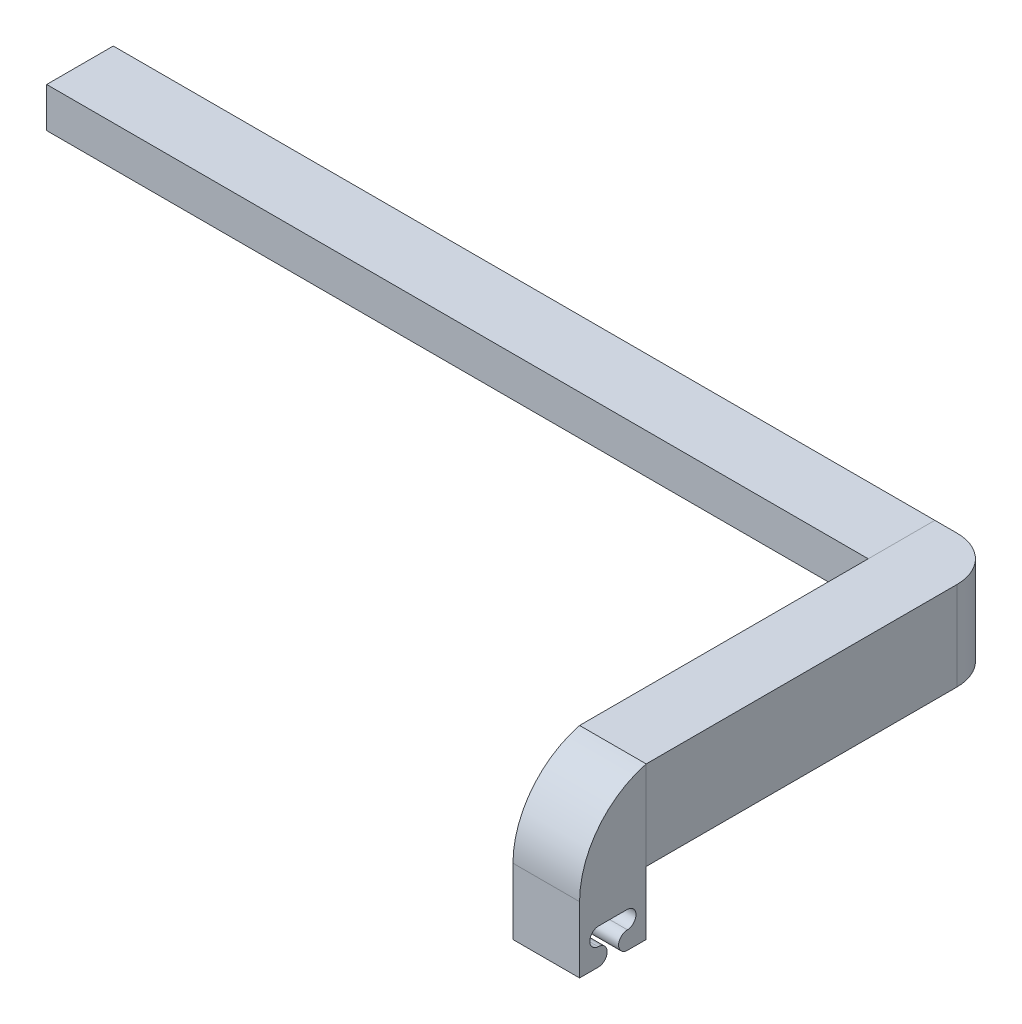
ISO-10303-21;
HEADER;
FILE_DESCRIPTION(('STEP AP214'),'2;1');
FILE_NAME('part.step','',(''),(''),'','','');
FILE_SCHEMA(('AUTOMOTIVE_DESIGN { 1 0 10303 214 1 1 1 1 }'));
ENDSEC;
DATA;
#1=APPLICATION_CONTEXT('core data for automotive mechanical design processes');
#2=APPLICATION_PROTOCOL_DEFINITION('international standard','automotive_design',2000,#1);
#3=PRODUCT_CONTEXT('',#1,'mechanical');
#4=PRODUCT('Part','Part','',(#3));
#5=PRODUCT_RELATED_PRODUCT_CATEGORY('part','',(#4));
#6=PRODUCT_DEFINITION_FORMATION('','',#4);
#7=PRODUCT_DEFINITION_CONTEXT('part definition',#1,'design');
#8=PRODUCT_DEFINITION('design','',#6,#7);
#9=PRODUCT_DEFINITION_SHAPE('','',#8);
#10=(LENGTH_UNIT() NAMED_UNIT(*) SI_UNIT(.MILLI.,.METRE.));
#11=(NAMED_UNIT(*) PLANE_ANGLE_UNIT() SI_UNIT($,.RADIAN.));
#12=(NAMED_UNIT(*) SI_UNIT($,.STERADIAN.) SOLID_ANGLE_UNIT());
#13=UNCERTAINTY_MEASURE_WITH_UNIT(LENGTH_MEASURE(1.E-05),#10,'distance_accuracy_value','');
#14=(GEOMETRIC_REPRESENTATION_CONTEXT(3) GLOBAL_UNCERTAINTY_ASSIGNED_CONTEXT((#13)) GLOBAL_UNIT_ASSIGNED_CONTEXT((#10,
#11,#12)) REPRESENTATION_CONTEXT('',''));
#15=CARTESIAN_POINT('',(0.,0.,0.));
#16=DIRECTION('',(0.,0.,1.));
#17=DIRECTION('',(1.,0.,0.));
#18=AXIS2_PLACEMENT_3D('',#15,#16,#17);
#19=CARTESIAN_POINT('',(44.416899440769,-15.6274777520744,-28.75));
#20=DIRECTION('',(1.,0.,0.));
#21=DIRECTION('',(0.,0.,-1.));
#22=AXIS2_PLACEMENT_3D('',#19,#20,#21);
#23=PLANE('',#22);
#24=DIRECTION('',(0.,-1.,0.));
#25=VECTOR('',#24,1.);
#26=CARTESIAN_POINT('',(44.416899440769,-15.6274777520745,-36.25));
#27=LINE('',#26,#25);
#28=CARTESIAN_POINT('',(44.416899440769,-15.6274777520745,-36.25));
#29=VERTEX_POINT('',#28);
#30=CARTESIAN_POINT('',(44.416899440769,-20.1274777520745,-36.25));
#31=VERTEX_POINT('',#30);
#32=EDGE_CURVE('E124',#29,#31,#27,.T.);
#33=ORIENTED_EDGE('',*,*,#32,.F.);
#34=DIRECTION('',(0.,0.,-1.));
#35=VECTOR('',#34,1.);
#36=CARTESIAN_POINT('',(44.416899440769,-15.6274777520744,-28.75));
#37=LINE('',#36,#35);
#38=CARTESIAN_POINT('',(44.416899440769,-15.6274777520744,-28.75));
#39=VERTEX_POINT('',#38);
#40=EDGE_CURVE('E12',#39,#29,#37,.T.);
#41=ORIENTED_EDGE('',*,*,#40,.F.);
#42=DIRECTION('',(0.,-1.,0.));
#43=VECTOR('',#42,1.);
#44=CARTESIAN_POINT('',(44.416899440769,-15.6274777520744,-28.75));
#45=LINE('',#44,#43);
#46=CARTESIAN_POINT('',(44.416899440769,-20.1274777520744,-28.75));
#47=VERTEX_POINT('',#46);
#48=EDGE_CURVE('E116',#39,#47,#45,.T.);
#49=ORIENTED_EDGE('',*,*,#48,.T.);
#50=DIRECTION('',(0.,0.,-1.));
#51=VECTOR('',#50,1.);
#52=CARTESIAN_POINT('',(44.416899440769,-20.1274777520744,-28.75));
#53=LINE('',#52,#51);
#54=EDGE_CURVE('E57',#47,#31,#53,.T.);
#55=ORIENTED_EDGE('',*,*,#54,.T.);
#56=EDGE_LOOP('',(#33,#41,#49,#55));
#57=FACE_BOUND('',#56,.T.);
#58=ADVANCED_FACE('F54',(#57),#23,.T.);
#59=CARTESIAN_POINT('',(44.416899440769,-15.6274777520744,-28.75));
#60=DIRECTION('',(0.,1.,0.));
#61=DIRECTION('',(0.,0.,1.));
#62=AXIS2_PLACEMENT_3D('',#59,#60,#61);
#63=PLANE('',#62);
#64=DIRECTION('',(1.,0.,0.));
#65=VECTOR('',#64,1.);
#66=CARTESIAN_POINT('',(44.416899440769,-15.6274777520745,-36.25));
#67=LINE('',#66,#65);
#68=CARTESIAN_POINT('',(-48.083100559231,-15.6274777520745,-36.25));
#69=VERTEX_POINT('',#68);
#70=EDGE_CURVE('E119',#69,#29,#67,.T.);
#71=ORIENTED_EDGE('',*,*,#70,.F.);
#72=DIRECTION('',(0.,0.,-1.));
#73=VECTOR('',#72,1.);
#74=CARTESIAN_POINT('',(-48.083100559231,-15.6274777520744,-28.75));
#75=LINE('',#74,#73);
#76=CARTESIAN_POINT('',(-48.083100559231,-15.6274777520744,-28.75));
#77=VERTEX_POINT('',#76);
#78=EDGE_CURVE('E64',#77,#69,#75,.T.);
#79=ORIENTED_EDGE('',*,*,#78,.F.);
#80=DIRECTION('',(1.,0.,0.));
#81=VECTOR('',#80,1.);
#82=CARTESIAN_POINT('',(44.416899440769,-15.6274777520744,-28.75));
#83=LINE('',#82,#81);
#84=EDGE_CURVE('E111',#77,#39,#83,.T.);
#85=ORIENTED_EDGE('',*,*,#84,.T.);
#86=ORIENTED_EDGE('',*,*,#40,.T.);
#87=EDGE_LOOP('',(#71,#79,#85,#86));
#88=FACE_BOUND('',#87,.T.);
#89=ADVANCED_FACE('F140',(#88),#63,.T.);
#90=CARTESIAN_POINT('',(-48.083100559231,-15.6274777520744,-28.75));
#91=DIRECTION('',(-1.,0.,0.));
#92=DIRECTION('',(0.,0.,1.));
#93=AXIS2_PLACEMENT_3D('',#90,#91,#92);
#94=PLANE('',#93);
#95=DIRECTION('',(0.,1.,0.));
#96=VECTOR('',#95,1.);
#97=CARTESIAN_POINT('',(-48.083100559231,-15.6274777520745,-36.25));
#98=LINE('',#97,#96);
#99=CARTESIAN_POINT('',(-48.083100559231,-20.1274777520745,-36.25));
#100=VERTEX_POINT('',#99);
#101=EDGE_CURVE('E105',#100,#69,#98,.T.);
#102=ORIENTED_EDGE('',*,*,#101,.F.);
#103=DIRECTION('',(0.,0.,-1.));
#104=VECTOR('',#103,1.);
#105=CARTESIAN_POINT('',(-48.083100559231,-20.1274777520744,-28.75));
#106=LINE('',#105,#104);
#107=CARTESIAN_POINT('',(-48.083100559231,-20.1274777520744,-28.75));
#108=VERTEX_POINT('',#107);
#109=EDGE_CURVE('E100',#108,#100,#106,.T.);
#110=ORIENTED_EDGE('',*,*,#109,.F.);
#111=DIRECTION('',(0.,1.,0.));
#112=VECTOR('',#111,1.);
#113=CARTESIAN_POINT('',(-48.083100559231,-15.6274777520744,-28.75));
#114=LINE('',#113,#112);
#115=EDGE_CURVE('E103',#108,#77,#114,.T.);
#116=ORIENTED_EDGE('',*,*,#115,.T.);
#117=ORIENTED_EDGE('',*,*,#78,.T.);
#118=EDGE_LOOP('',(#102,#110,#116,#117));
#119=FACE_BOUND('',#118,.T.);
#120=ADVANCED_FACE('F102',(#119),#94,.T.);
#121=CARTESIAN_POINT('',(44.416899440769,-20.1274777520744,-28.75));
#122=DIRECTION('',(0.,-1.,0.));
#123=DIRECTION('',(0.,0.,-1.));
#124=AXIS2_PLACEMENT_3D('',#121,#122,#123);
#125=PLANE('',#124);
#126=DIRECTION('',(-1.,0.,0.));
#127=VECTOR('',#126,1.);
#128=CARTESIAN_POINT('',(44.416899440769,-20.1274777520745,-36.25));
#129=LINE('',#128,#127);
#130=EDGE_CURVE('E128',#31,#100,#129,.T.);
#131=ORIENTED_EDGE('',*,*,#130,.F.);
#132=ORIENTED_EDGE('',*,*,#54,.F.);
#133=DIRECTION('',(-1.,0.,0.));
#134=VECTOR('',#133,1.);
#135=CARTESIAN_POINT('',(44.416899440769,-20.1274777520744,-28.75));
#136=LINE('',#135,#134);
#137=EDGE_CURVE('E110',#47,#108,#136,.T.);
#138=ORIENTED_EDGE('',*,*,#137,.T.);
#139=ORIENTED_EDGE('',*,*,#109,.T.);
#140=EDGE_LOOP('',(#131,#132,#138,#139));
#141=FACE_BOUND('',#140,.T.);
#142=ADVANCED_FACE('F114',(#141),#125,.T.);
#143=CARTESIAN_POINT('',(0.,0.,-28.75));
#144=DIRECTION('',(0.,0.,-1.));
#145=DIRECTION('',(-1.,0.,0.));
#146=AXIS2_PLACEMENT_3D('',#143,#144,#145);
#147=PLANE('',#146);
#148=ORIENTED_EDGE('',*,*,#48,.F.);
#149=ORIENTED_EDGE('',*,*,#84,.F.);
#150=ORIENTED_EDGE('',*,*,#115,.F.);
#151=ORIENTED_EDGE('',*,*,#137,.F.);
#152=EDGE_LOOP('',(#148,#149,#150,#151));
#153=FACE_BOUND('',#152,.T.);
#154=ADVANCED_FACE('F109',(#153),#147,.F.);
#155=CARTESIAN_POINT('',(0.,0.,-36.25));
#156=DIRECTION('',(0.,0.,-1.));
#157=DIRECTION('',(-1.,0.,0.));
#158=AXIS2_PLACEMENT_3D('',#155,#156,#157);
#159=PLANE('',#158);
#160=ORIENTED_EDGE('',*,*,#32,.T.);
#161=ORIENTED_EDGE('',*,*,#130,.T.);
#162=ORIENTED_EDGE('',*,*,#101,.T.);
#163=ORIENTED_EDGE('',*,*,#70,.T.);
#164=EDGE_LOOP('',(#160,#161,#162,#163));
#165=FACE_BOUND('',#164,.T.);
#166=ADVANCED_FACE('F139',(#165),#159,.T.);
#167=CLOSED_SHELL('',(#58,#89,#120,#142,#154,#166));
#168=MANIFOLD_SOLID_BREP('B2',#167);
#169=CARTESIAN_POINT('',(44.416899440769,-15.6274777520745,3.75));
#170=DIRECTION('',(0.,0.,1.));
#171=DIRECTION('',(0.,-1.,0.));
#172=AXIS2_PLACEMENT_3D('',#169,#170,#171);
#173=PLANE('',#172);
#174=DIRECTION('',(0.,-1.,0.));
#175=VECTOR('',#174,1.);
#176=CARTESIAN_POINT('',(51.916899440769,-15.6274777520745,3.75));
#177=LINE('',#176,#175);
#178=CARTESIAN_POINT('',(51.916899440769,-15.6274777520745,3.75));
#179=VERTEX_POINT('',#178);
#180=CARTESIAN_POINT('',(51.916899440769,-25.6274777520745,3.75));
#181=VERTEX_POINT('',#180);
#182=EDGE_CURVE('E275',#179,#181,#177,.T.);
#183=ORIENTED_EDGE('',*,*,#182,.F.);
#184=DIRECTION('',(1.,0.,0.));
#185=VECTOR('',#184,1.);
#186=CARTESIAN_POINT('',(44.416899440769,-15.6274777520745,3.75));
#187=LINE('',#186,#185);
#188=CARTESIAN_POINT('',(44.416899440769,-15.6274777520745,3.75));
#189=VERTEX_POINT('',#188);
#190=EDGE_CURVE('E268',#189,#179,#187,.T.);
#191=ORIENTED_EDGE('',*,*,#190,.F.);
#192=DIRECTION('',(0.,-1.,0.));
#193=VECTOR('',#192,1.);
#194=CARTESIAN_POINT('',(44.416899440769,-15.6274777520745,3.75));
#195=LINE('',#194,#193);
#196=CARTESIAN_POINT('',(44.416899440769,-25.6274777520745,3.75));
#197=VERTEX_POINT('',#196);
#198=EDGE_CURVE('E262',#189,#197,#195,.T.);
#199=ORIENTED_EDGE('',*,*,#198,.T.);
#200=DIRECTION('',(1.,0.,0.));
#201=VECTOR('',#200,1.);
#202=CARTESIAN_POINT('',(44.416899440769,-25.6274777520745,3.75));
#203=LINE('',#202,#201);
#204=EDGE_CURVE('E244',#197,#181,#203,.T.);
#205=ORIENTED_EDGE('',*,*,#204,.T.);
#206=EDGE_LOOP('',(#183,#191,#199,#205));
#207=FACE_BOUND('',#206,.T.);
#208=ADVANCED_FACE('F199',(#207),#173,.T.);
#209=CARTESIAN_POINT('',(44.416899440769,-15.6274777520745,3.75));
#210=DIRECTION('',(0.,1.,0.));
#211=DIRECTION('',(0.,0.,1.));
#212=AXIS2_PLACEMENT_3D('',#209,#210,#211);
#213=PLANE('',#212);
#214=DIRECTION('',(0.,0.,1.));
#215=VECTOR('',#214,1.);
#216=CARTESIAN_POINT('',(51.916899440769,-15.6274777520745,3.75));
#217=LINE('',#216,#215);
#218=CARTESIAN_POINT('',(51.916899440769,-15.6274777520745,-31.25));
#219=VERTEX_POINT('',#218);
#220=EDGE_CURVE('E269',#219,#179,#217,.T.);
#221=ORIENTED_EDGE('',*,*,#220,.F.);
#222=CARTESIAN_POINT('',(46.916899440769,-15.6274777520745,-31.25));
#223=DIRECTION('',(0.,1.,0.));
#224=DIRECTION('',(0.,0.,1.));
#225=AXIS2_PLACEMENT_3D('',#222,#223,#224);
#226=CIRCLE('',#225,5.);
#227=CARTESIAN_POINT('',(46.916899440769,-15.6274777520745,-36.25));
#228=VERTEX_POINT('',#227);
#229=EDGE_CURVE('E221',#219,#228,#226,.T.);
#230=ORIENTED_EDGE('',*,*,#229,.T.);
#231=DIRECTION('',(1.,0.,0.));
#232=VECTOR('',#231,1.);
#233=CARTESIAN_POINT('',(44.416899440769,-15.6274777520745,-36.25));
#234=LINE('',#233,#232);
#235=CARTESIAN_POINT('',(44.416899440769,-15.6274777520745,-36.25));
#236=VERTEX_POINT('',#235);
#237=EDGE_CURVE('E280',#236,#228,#234,.T.);
#238=ORIENTED_EDGE('',*,*,#237,.F.);
#239=DIRECTION('',(0.,0.,1.));
#240=VECTOR('',#239,1.);
#241=CARTESIAN_POINT('',(44.416899440769,-15.6274777520745,3.75));
#242=LINE('',#241,#240);
#243=EDGE_CURVE('E255',#236,#189,#242,.T.);
#244=ORIENTED_EDGE('',*,*,#243,.T.);
#245=ORIENTED_EDGE('',*,*,#190,.T.);
#246=EDGE_LOOP('',(#221,#230,#238,#244,#245));
#247=FACE_BOUND('',#246,.T.);
#248=ADVANCED_FACE('F290',(#247),#213,.T.);
#249=CARTESIAN_POINT('',(44.416899440769,-15.6274777520745,-36.25));
#250=DIRECTION('',(0.,0.,-1.));
#251=DIRECTION('',(0.,1.,0.));
#252=AXIS2_PLACEMENT_3D('',#249,#250,#251);
#253=PLANE('',#252);
#254=ORIENTED_EDGE('',*,*,#237,.T.);
#255=DIRECTION('',(0.,1.,0.));
#256=VECTOR('',#255,1.);
#257=CARTESIAN_POINT('',(46.916899440769,-15.6274777520745,-36.25));
#258=LINE('',#257,#256);
#259=CARTESIAN_POINT('',(46.916899440769,-25.6274777520745,-36.25));
#260=VERTEX_POINT('',#259);
#261=EDGE_CURVE('E207',#228,#260,#258,.F.);
#262=ORIENTED_EDGE('',*,*,#261,.T.);
#263=DIRECTION('',(1.,0.,0.));
#264=VECTOR('',#263,1.);
#265=CARTESIAN_POINT('',(44.416899440769,-25.6274777520745,-36.25));
#266=LINE('',#265,#264);
#267=CARTESIAN_POINT('',(44.416899440769,-25.6274777520745,-36.25));
#268=VERTEX_POINT('',#267);
#269=EDGE_CURVE('E254',#268,#260,#266,.T.);
#270=ORIENTED_EDGE('',*,*,#269,.F.);
#271=DIRECTION('',(0.,1.,0.));
#272=VECTOR('',#271,1.);
#273=CARTESIAN_POINT('',(44.416899440769,-15.6274777520745,-36.25));
#274=LINE('',#273,#272);
#275=EDGE_CURVE('E265',#268,#236,#274,.T.);
#276=ORIENTED_EDGE('',*,*,#275,.T.);
#277=EDGE_LOOP('',(#254,#262,#270,#276));
#278=FACE_BOUND('',#277,.T.);
#279=ADVANCED_FACE('F291',(#278),#253,.T.);
#280=CARTESIAN_POINT('',(44.416899440769,-25.6274777520745,3.75));
#281=DIRECTION('',(0.,-1.,0.));
#282=DIRECTION('',(0.,0.,-1.));
#283=AXIS2_PLACEMENT_3D('',#280,#281,#282);
#284=PLANE('',#283);
#285=ORIENTED_EDGE('',*,*,#269,.T.);
#286=CARTESIAN_POINT('',(46.916899440769,-25.6274777520745,-31.25));
#287=DIRECTION('',(0.,-1.,0.));
#288=DIRECTION('',(0.,0.,-1.));
#289=AXIS2_PLACEMENT_3D('',#286,#287,#288);
#290=CIRCLE('',#289,5.);
#291=CARTESIAN_POINT('',(51.916899440769,-25.6274777520745,-31.25));
#292=VERTEX_POINT('',#291);
#293=EDGE_CURVE('E52',#260,#292,#290,.T.);
#294=ORIENTED_EDGE('',*,*,#293,.T.);
#295=DIRECTION('',(0.,0.,-1.));
#296=VECTOR('',#295,1.);
#297=CARTESIAN_POINT('',(51.916899440769,-25.6274777520745,3.75));
#298=LINE('',#297,#296);
#299=EDGE_CURVE('E249',#181,#292,#298,.T.);
#300=ORIENTED_EDGE('',*,*,#299,.F.);
#301=ORIENTED_EDGE('',*,*,#204,.F.);
#302=DIRECTION('',(0.,0.,-1.));
#303=VECTOR('',#302,1.);
#304=CARTESIAN_POINT('',(44.416899440769,-25.6274777520745,3.75));
#305=LINE('',#304,#303);
#306=EDGE_CURVE('E247',#197,#268,#305,.T.);
#307=ORIENTED_EDGE('',*,*,#306,.T.);
#308=EDGE_LOOP('',(#285,#294,#300,#301,#307));
#309=FACE_BOUND('',#308,.T.);
#310=ADVANCED_FACE('F246',(#309),#284,.T.);
#311=CARTESIAN_POINT('',(44.416899440769,0.,0.));
#312=DIRECTION('',(1.,0.,0.));
#313=DIRECTION('',(0.,0.,-1.));
#314=AXIS2_PLACEMENT_3D('',#311,#312,#313);
#315=PLANE('',#314);
#316=ORIENTED_EDGE('',*,*,#198,.F.);
#317=ORIENTED_EDGE('',*,*,#243,.F.);
#318=ORIENTED_EDGE('',*,*,#275,.F.);
#319=ORIENTED_EDGE('',*,*,#306,.F.);
#320=EDGE_LOOP('',(#316,#317,#318,#319));
#321=FACE_BOUND('',#320,.T.);
#322=ADVANCED_FACE('F260',(#321),#315,.F.);
#323=CARTESIAN_POINT('',(51.916899440769,0.,0.));
#324=DIRECTION('',(1.,0.,0.));
#325=DIRECTION('',(0.,0.,-1.));
#326=AXIS2_PLACEMENT_3D('',#323,#324,#325);
#327=PLANE('',#326);
#328=ORIENTED_EDGE('',*,*,#299,.T.);
#329=DIRECTION('',(0.,1.,0.));
#330=VECTOR('',#329,1.);
#331=CARTESIAN_POINT('',(51.916899440769,0.,-31.25));
#332=LINE('',#331,#330);
#333=EDGE_CURVE('E279',#292,#219,#332,.T.);
#334=ORIENTED_EDGE('',*,*,#333,.T.);
#335=ORIENTED_EDGE('',*,*,#220,.T.);
#336=ORIENTED_EDGE('',*,*,#182,.T.);
#337=EDGE_LOOP('',(#328,#334,#335,#336));
#338=FACE_BOUND('',#337,.T.);
#339=ADVANCED_FACE('F287',(#338),#327,.T.);
#340=CARTESIAN_POINT('',(46.916899440769,0.,-31.25));
#341=DIRECTION('',(0.,1.,0.));
#342=DIRECTION('',(0.,0.,1.));
#343=AXIS2_PLACEMENT_3D('',#340,#341,#342);
#344=CYLINDRICAL_SURFACE('',#343,5.);
#345=ORIENTED_EDGE('',*,*,#293,.F.);
#346=ORIENTED_EDGE('',*,*,#261,.F.);
#347=ORIENTED_EDGE('',*,*,#229,.F.);
#348=ORIENTED_EDGE('',*,*,#333,.F.);
#349=EDGE_LOOP('',(#345,#346,#347,#348));
#350=FACE_BOUND('',#349,.T.);
#351=ADVANCED_FACE('F201',(#350),#344,.T.);
#352=CLOSED_SHELL('',(#208,#248,#279,#310,#322,#339,#351));
#353=MANIFOLD_SOLID_BREP('B6',#352);
#354=CARTESIAN_POINT('',(0.,0.,11.25));
#355=DIRECTION('',(0.,0.,1.));
#356=DIRECTION('',(1.,0.,0.));
#357=AXIS2_PLACEMENT_3D('',#354,#355,#356);
#358=PLANE('',#357);
#359=DIRECTION('',(0.,1.,0.));
#360=VECTOR('',#359,1.);
#361=CARTESIAN_POINT('',(51.916899440769,0.,11.25));
#362=LINE('',#361,#360);
#363=CARTESIAN_POINT('',(51.916899440769,-32.7524777520744,11.25));
#364=VERTEX_POINT('',#363);
#365=CARTESIAN_POINT('',(51.916899440769,-25.309936117593,11.25));
#366=VERTEX_POINT('',#365);
#367=EDGE_CURVE('E493',#364,#366,#362,.T.);
#368=ORIENTED_EDGE('',*,*,#367,.T.);
#369=DIRECTION('',(1.,0.,0.));
#370=VECTOR('',#369,1.);
#371=CARTESIAN_POINT('',(44.4168994407689,-25.309936117593,11.25));
#372=LINE('',#371,#370);
#373=CARTESIAN_POINT('',(44.416899440769,-25.309936117593,11.25));
#374=VERTEX_POINT('',#373);
#375=EDGE_CURVE('E496',#366,#374,#372,.F.);
#376=ORIENTED_EDGE('',*,*,#375,.T.);
#377=DIRECTION('',(0.,1.,0.));
#378=VECTOR('',#377,1.);
#379=CARTESIAN_POINT('',(44.4168994407689,0.,11.25));
#380=LINE('',#379,#378);
#381=CARTESIAN_POINT('',(44.416899440769,-32.7524777520744,11.25));
#382=VERTEX_POINT('',#381);
#383=EDGE_CURVE('E490',#382,#374,#380,.T.);
#384=ORIENTED_EDGE('',*,*,#383,.F.);
#385=DIRECTION('',(-1.,0.,0.));
#386=VECTOR('',#385,1.);
#387=CARTESIAN_POINT('',(51.916899440769,-32.7524777520744,11.25));
#388=LINE('',#387,#386);
#389=EDGE_CURVE('E478',#364,#382,#388,.T.);
#390=ORIENTED_EDGE('',*,*,#389,.F.);
#391=EDGE_LOOP('',(#368,#376,#384,#390));
#392=FACE_BOUND('',#391,.T.);
#393=ADVANCED_FACE('F349',(#392),#358,.T.);
#394=CARTESIAN_POINT('',(0.,0.,3.75));
#395=DIRECTION('',(0.,0.,1.));
#396=DIRECTION('',(1.,0.,0.));
#397=AXIS2_PLACEMENT_3D('',#394,#395,#396);
#398=PLANE('',#397);
#399=DIRECTION('',(0.,1.,0.));
#400=VECTOR('',#399,1.);
#401=CARTESIAN_POINT('',(51.916899440769,0.,3.75));
#402=LINE('',#401,#400);
#403=CARTESIAN_POINT('',(51.916899440769,-32.7524777520744,3.75));
#404=VERTEX_POINT('',#403);
#405=CARTESIAN_POINT('',(51.916899440769,-15.6274777520745,3.75));
#406=VERTEX_POINT('',#405);
#407=EDGE_CURVE('E499',#404,#406,#402,.T.);
#408=ORIENTED_EDGE('',*,*,#407,.F.);
#409=DIRECTION('',(-1.,0.,0.));
#410=VECTOR('',#409,1.);
#411=CARTESIAN_POINT('',(51.916899440769,-32.7524777520744,3.75));
#412=LINE('',#411,#410);
#413=CARTESIAN_POINT('',(44.416899440769,-32.7524777520744,3.75));
#414=VERTEX_POINT('',#413);
#415=EDGE_CURVE('E480',#404,#414,#412,.T.);
#416=ORIENTED_EDGE('',*,*,#415,.T.);
#417=DIRECTION('',(0.,1.,0.));
#418=VECTOR('',#417,1.);
#419=CARTESIAN_POINT('',(44.4168994407689,0.,3.75));
#420=LINE('',#419,#418);
#421=CARTESIAN_POINT('',(44.416899440769,-15.6274777520744,3.75));
#422=VERTEX_POINT('',#421);
#423=EDGE_CURVE('E477',#414,#422,#420,.T.);
#424=ORIENTED_EDGE('',*,*,#423,.T.);
#425=DIRECTION('',(-1.,0.,0.));
#426=VECTOR('',#425,1.);
#427=CARTESIAN_POINT('',(0.,-15.6274777520744,3.75));
#428=LINE('',#427,#426);
#429=EDGE_CURVE('E494',#406,#422,#428,.T.);
#430=ORIENTED_EDGE('',*,*,#429,.F.);
#431=EDGE_LOOP('',(#408,#416,#424,#430));
#432=FACE_BOUND('',#431,.T.);
#433=ADVANCED_FACE('F510',(#432),#398,.F.);
#434=CARTESIAN_POINT('',(51.916899440769,0.,11.25));
#435=DIRECTION('',(-1.,0.,0.));
#436=DIRECTION('',(0.,0.,1.));
#437=AXIS2_PLACEMENT_3D('',#434,#435,#436);
#438=PLANE('',#437);
#439=ORIENTED_EDGE('',*,*,#407,.T.);
#440=CARTESIAN_POINT('',(51.916899440769,-25.309936117593,1.25));
#441=DIRECTION('',(-1.,0.,0.));
#442=DIRECTION('',(0.,0.,1.));
#443=AXIS2_PLACEMENT_3D('',#440,#441,#442);
#444=CIRCLE('',#443,10.);
#445=EDGE_CURVE('E197',#406,#366,#444,.F.);
#446=ORIENTED_EDGE('',*,*,#445,.T.);
#447=ORIENTED_EDGE('',*,*,#367,.F.);
#448=DIRECTION('',(0.,0.,1.));
#449=VECTOR('',#448,1.);
#450=CARTESIAN_POINT('',(51.916899440769,-32.7524777520744,0.));
#451=LINE('',#450,#449);
#452=CARTESIAN_POINT('',(51.916899440769,-32.7524777520744,9.14154578551342));
#453=VERTEX_POINT('',#452);
#454=EDGE_CURVE('E437',#453,#364,#451,.T.);
#455=ORIENTED_EDGE('',*,*,#454,.F.);
#456=CARTESIAN_POINT('',(51.916899440769,-31.7524777520744,9.14154578551342));
#457=DIRECTION('',(-1.,0.,0.));
#458=DIRECTION('',(0.,-1.,0.));
#459=AXIS2_PLACEMENT_3D('',#456,#457,#458);
#460=CIRCLE('',#459,1.);
#461=CARTESIAN_POINT('',(51.916899440769,-30.7524777520744,9.14154578551342));
#462=VERTEX_POINT('',#461);
#463=EDGE_CURVE('E429',#453,#462,#460,.F.);
#464=ORIENTED_EDGE('',*,*,#463,.T.);
#465=CARTESIAN_POINT('',(51.916899440769,-29.7524777520744,9.09725259773677));
#466=DIRECTION('',(-1.,0.,0.));
#467=DIRECTION('',(0.,-1.,0.));
#468=AXIS2_PLACEMENT_3D('',#465,#466,#467);
#469=CIRCLE('',#468,1.00098046258827);
#470=CARTESIAN_POINT('',(51.916899440769,-28.7524777520744,9.14154578551342));
#471=VERTEX_POINT('',#470);
#472=EDGE_CURVE('E441',#462,#471,#469,.T.);
#473=ORIENTED_EDGE('',*,*,#472,.T.);
#474=DIRECTION('',(0.,0.,1.));
#475=VECTOR('',#474,1.);
#476=CARTESIAN_POINT('',(51.916899440769,-28.7524777520744,0.));
#477=LINE('',#476,#475);
#478=CARTESIAN_POINT('',(51.916899440769,-28.7524777520744,5.85845421448658));
#479=VERTEX_POINT('',#478);
#480=EDGE_CURVE('E444',#479,#471,#477,.T.);
#481=ORIENTED_EDGE('',*,*,#480,.F.);
#482=CARTESIAN_POINT('',(51.916899440769,-29.7524777520744,5.90274740226323));
#483=DIRECTION('',(-1.,0.,0.));
#484=DIRECTION('',(0.,-1.,0.));
#485=AXIS2_PLACEMENT_3D('',#482,#483,#484);
#486=CIRCLE('',#485,1.00098046258827);
#487=CARTESIAN_POINT('',(51.916899440769,-30.7524777520744,5.85845421448658));
#488=VERTEX_POINT('',#487);
#489=EDGE_CURVE('E454',#488,#479,#486,.F.);
#490=ORIENTED_EDGE('',*,*,#489,.F.);
#491=CARTESIAN_POINT('',(51.916899440769,-31.7524777520744,5.85845421448658));
#492=DIRECTION('',(-1.,0.,0.));
#493=DIRECTION('',(0.,-1.,0.));
#494=AXIS2_PLACEMENT_3D('',#491,#492,#493);
#495=CIRCLE('',#494,1.);
#496=CARTESIAN_POINT('',(51.916899440769,-32.7524777520744,5.85845421448658));
#497=VERTEX_POINT('',#496);
#498=EDGE_CURVE('E456',#497,#488,#495,.T.);
#499=ORIENTED_EDGE('',*,*,#498,.F.);
#500=DIRECTION('',(0.,0.,-1.));
#501=VECTOR('',#500,1.);
#502=CARTESIAN_POINT('',(51.916899440769,-32.7524777520744,0.));
#503=LINE('',#502,#501);
#504=EDGE_CURVE('E458',#497,#404,#503,.T.);
#505=ORIENTED_EDGE('',*,*,#504,.T.);
#506=EDGE_LOOP('',(#439,#446,#447,#455,#464,#473,#481,#490,#499,#505));
#507=FACE_BOUND('',#506,.T.);
#508=ADVANCED_FACE('F446',(#507),#438,.F.);
#509=CARTESIAN_POINT('',(44.4168994407689,0.,11.25));
#510=DIRECTION('',(-1.,0.,0.));
#511=DIRECTION('',(0.,-1.,0.));
#512=AXIS2_PLACEMENT_3D('',#509,#510,#511);
#513=PLANE('',#512);
#514=ORIENTED_EDGE('',*,*,#383,.T.);
#515=CARTESIAN_POINT('',(44.416899440769,-25.309936117593,1.25));
#516=DIRECTION('',(-1.,0.,0.));
#517=DIRECTION('',(0.,-1.,0.));
#518=AXIS2_PLACEMENT_3D('',#515,#516,#517);
#519=CIRCLE('',#518,10.);
#520=EDGE_CURVE('E357',#374,#422,#519,.T.);
#521=ORIENTED_EDGE('',*,*,#520,.T.);
#522=ORIENTED_EDGE('',*,*,#423,.F.);
#523=DIRECTION('',(0.,0.,-1.));
#524=VECTOR('',#523,1.);
#525=CARTESIAN_POINT('',(44.416899440769,-32.7524777520744,0.));
#526=LINE('',#525,#524);
#527=CARTESIAN_POINT('',(44.416899440769,-32.7524777520744,5.85845421448658));
#528=VERTEX_POINT('',#527);
#529=EDGE_CURVE('E450',#528,#414,#526,.T.);
#530=ORIENTED_EDGE('',*,*,#529,.F.);
#531=CARTESIAN_POINT('',(44.416899440769,-31.7524777520744,5.85845421448658));
#532=DIRECTION('',(-1.,0.,0.));
#533=DIRECTION('',(0.,-1.,0.));
#534=AXIS2_PLACEMENT_3D('',#531,#532,#533);
#535=CIRCLE('',#534,1.);
#536=CARTESIAN_POINT('',(44.416899440769,-30.7524777520744,5.85845421448658));
#537=VERTEX_POINT('',#536);
#538=EDGE_CURVE('E471',#528,#537,#535,.T.);
#539=ORIENTED_EDGE('',*,*,#538,.T.);
#540=CARTESIAN_POINT('',(44.416899440769,-29.7524777520744,5.90274740226323));
#541=DIRECTION('',(-1.,0.,0.));
#542=DIRECTION('',(0.,-1.,0.));
#543=AXIS2_PLACEMENT_3D('',#540,#541,#542);
#544=CIRCLE('',#543,1.00098046258827);
#545=CARTESIAN_POINT('',(44.416899440769,-28.7524777520744,5.85845421448658));
#546=VERTEX_POINT('',#545);
#547=EDGE_CURVE('E468',#537,#546,#544,.F.);
#548=ORIENTED_EDGE('',*,*,#547,.T.);
#549=DIRECTION('',(0.,0.,1.));
#550=VECTOR('',#549,1.);
#551=CARTESIAN_POINT('',(44.416899440769,-28.7524777520744,0.));
#552=LINE('',#551,#550);
#553=CARTESIAN_POINT('',(44.416899440769,-28.7524777520744,9.14154578551342));
#554=VERTEX_POINT('',#553);
#555=EDGE_CURVE('E465',#546,#554,#552,.T.);
#556=ORIENTED_EDGE('',*,*,#555,.T.);
#557=CARTESIAN_POINT('',(44.416899440769,-29.7524777520744,9.09725259773677));
#558=DIRECTION('',(-1.,0.,0.));
#559=DIRECTION('',(0.,-1.,0.));
#560=AXIS2_PLACEMENT_3D('',#557,#558,#559);
#561=CIRCLE('',#560,1.00098046258827);
#562=CARTESIAN_POINT('',(44.416899440769,-30.7524777520744,9.14154578551342));
#563=VERTEX_POINT('',#562);
#564=EDGE_CURVE('E463',#563,#554,#561,.T.);
#565=ORIENTED_EDGE('',*,*,#564,.F.);
#566=CARTESIAN_POINT('',(44.416899440769,-31.7524777520744,9.14154578551342));
#567=DIRECTION('',(-1.,0.,0.));
#568=DIRECTION('',(0.,-1.,0.));
#569=AXIS2_PLACEMENT_3D('',#566,#567,#568);
#570=CIRCLE('',#569,1.);
#571=CARTESIAN_POINT('',(44.416899440769,-32.7524777520744,9.14154578551342));
#572=VERTEX_POINT('',#571);
#573=EDGE_CURVE('E432',#572,#563,#570,.F.);
#574=ORIENTED_EDGE('',*,*,#573,.F.);
#575=DIRECTION('',(0.,0.,1.));
#576=VECTOR('',#575,1.);
#577=CARTESIAN_POINT('',(44.416899440769,-32.7524777520744,0.));
#578=LINE('',#577,#576);
#579=EDGE_CURVE('E447',#572,#382,#578,.T.);
#580=ORIENTED_EDGE('',*,*,#579,.T.);
#581=EDGE_LOOP('',(#514,#521,#522,#530,#539,#548,#556,#565,#574,#580));
#582=FACE_BOUND('',#581,.T.);
#583=ADVANCED_FACE('F504',(#582),#513,.T.);
#584=CARTESIAN_POINT('',(51.916899440769,-32.7524777520744,0.));
#585=DIRECTION('',(0.,1.,0.));
#586=DIRECTION('',(-1.,0.,0.));
#587=AXIS2_PLACEMENT_3D('',#584,#585,#586);
#588=PLANE('',#587);
#589=ORIENTED_EDGE('',*,*,#529,.T.);
#590=ORIENTED_EDGE('',*,*,#415,.F.);
#591=ORIENTED_EDGE('',*,*,#504,.F.);
#592=DIRECTION('',(-1.,0.,0.));
#593=VECTOR('',#592,1.);
#594=CARTESIAN_POINT('',(51.916899440769,-32.7524777520744,5.85845421448658));
#595=LINE('',#594,#593);
#596=EDGE_CURVE('E483',#497,#528,#595,.T.);
#597=ORIENTED_EDGE('',*,*,#596,.T.);
#598=EDGE_LOOP('',(#589,#590,#591,#597));
#599=FACE_BOUND('',#598,.T.);
#600=ADVANCED_FACE('F531',(#599),#588,.F.);
#601=CARTESIAN_POINT('',(51.916899440769,-29.7524777520744,9.09725259773677));
#602=DIRECTION('',(-1.,0.,0.));
#603=DIRECTION('',(0.,-1.,0.));
#604=AXIS2_PLACEMENT_3D('',#601,#602,#603);
#605=CYLINDRICAL_SURFACE('',#604,1.00098046258827);
#606=ORIENTED_EDGE('',*,*,#564,.T.);
#607=DIRECTION('',(-1.,0.,0.));
#608=VECTOR('',#607,1.);
#609=CARTESIAN_POINT('',(51.916899440769,-28.7524777520744,9.14154578551342));
#610=LINE('',#609,#608);
#611=EDGE_CURVE('E436',#471,#554,#610,.T.);
#612=ORIENTED_EDGE('',*,*,#611,.F.);
#613=ORIENTED_EDGE('',*,*,#472,.F.);
#614=DIRECTION('',(-1.,0.,0.));
#615=VECTOR('',#614,1.);
#616=CARTESIAN_POINT('',(51.916899440769,-30.7524777520744,9.14154578551342));
#617=LINE('',#616,#615);
#618=EDGE_CURVE('E425',#462,#563,#617,.T.);
#619=ORIENTED_EDGE('',*,*,#618,.T.);
#620=EDGE_LOOP('',(#606,#612,#613,#619));
#621=FACE_BOUND('',#620,.T.);
#622=ADVANCED_FACE('F442',(#621),#605,.F.);
#623=CARTESIAN_POINT('',(51.916899440769,-28.7524777520744,0.));
#624=DIRECTION('',(0.,-1.,0.));
#625=DIRECTION('',(1.,0.,0.));
#626=AXIS2_PLACEMENT_3D('',#623,#624,#625);
#627=PLANE('',#626);
#628=ORIENTED_EDGE('',*,*,#555,.F.);
#629=DIRECTION('',(-1.,0.,0.));
#630=VECTOR('',#629,1.);
#631=CARTESIAN_POINT('',(51.916899440769,-28.7524777520744,5.85845421448658));
#632=LINE('',#631,#630);
#633=EDGE_CURVE('E487',#479,#546,#632,.T.);
#634=ORIENTED_EDGE('',*,*,#633,.F.);
#635=ORIENTED_EDGE('',*,*,#480,.T.);
#636=ORIENTED_EDGE('',*,*,#611,.T.);
#637=EDGE_LOOP('',(#628,#634,#635,#636));
#638=FACE_BOUND('',#637,.T.);
#639=ADVANCED_FACE('F520',(#638),#627,.T.);
#640=CARTESIAN_POINT('',(51.916899440769,-29.7524777520744,5.90274740226323));
#641=DIRECTION('',(-1.,0.,0.));
#642=DIRECTION('',(0.,-1.,0.));
#643=AXIS2_PLACEMENT_3D('',#640,#641,#642);
#644=CYLINDRICAL_SURFACE('',#643,1.00098046258827);
#645=ORIENTED_EDGE('',*,*,#547,.F.);
#646=DIRECTION('',(-1.,0.,0.));
#647=VECTOR('',#646,1.);
#648=CARTESIAN_POINT('',(51.916899440769,-30.7524777520744,5.85845421448658));
#649=LINE('',#648,#647);
#650=EDGE_CURVE('E485',#488,#537,#649,.T.);
#651=ORIENTED_EDGE('',*,*,#650,.F.);
#652=ORIENTED_EDGE('',*,*,#489,.T.);
#653=ORIENTED_EDGE('',*,*,#633,.T.);
#654=EDGE_LOOP('',(#645,#651,#652,#653));
#655=FACE_BOUND('',#654,.T.);
#656=ADVANCED_FACE('F525',(#655),#644,.F.);
#657=CARTESIAN_POINT('',(51.916899440769,-31.7524777520744,5.85845421448658));
#658=DIRECTION('',(-1.,0.,0.));
#659=DIRECTION('',(0.,-1.,0.));
#660=AXIS2_PLACEMENT_3D('',#657,#658,#659);
#661=CYLINDRICAL_SURFACE('',#660,1.);
#662=ORIENTED_EDGE('',*,*,#538,.F.);
#663=ORIENTED_EDGE('',*,*,#596,.F.);
#664=ORIENTED_EDGE('',*,*,#498,.T.);
#665=ORIENTED_EDGE('',*,*,#650,.T.);
#666=EDGE_LOOP('',(#662,#663,#664,#665));
#667=FACE_BOUND('',#666,.T.);
#668=ADVANCED_FACE('F528',(#667),#661,.T.);
#669=CARTESIAN_POINT('',(51.916899440769,-32.7524777520744,0.));
#670=DIRECTION('',(0.,-1.,0.));
#671=DIRECTION('',(1.,0.,0.));
#672=AXIS2_PLACEMENT_3D('',#669,#670,#671);
#673=PLANE('',#672);
#674=ORIENTED_EDGE('',*,*,#579,.F.);
#675=DIRECTION('',(-1.,0.,0.));
#676=VECTOR('',#675,1.);
#677=CARTESIAN_POINT('',(51.916899440769,-32.7524777520744,9.14154578551342));
#678=LINE('',#677,#676);
#679=EDGE_CURVE('E475',#453,#572,#678,.T.);
#680=ORIENTED_EDGE('',*,*,#679,.F.);
#681=ORIENTED_EDGE('',*,*,#454,.T.);
#682=ORIENTED_EDGE('',*,*,#389,.T.);
#683=EDGE_LOOP('',(#674,#680,#681,#682));
#684=FACE_BOUND('',#683,.T.);
#685=ADVANCED_FACE('F515',(#684),#673,.T.);
#686=CARTESIAN_POINT('',(51.916899440769,-31.7524777520744,9.14154578551342));
#687=DIRECTION('',(-1.,0.,0.));
#688=DIRECTION('',(0.,-1.,0.));
#689=AXIS2_PLACEMENT_3D('',#686,#687,#688);
#690=CYLINDRICAL_SURFACE('',#689,1.);
#691=ORIENTED_EDGE('',*,*,#573,.T.);
#692=ORIENTED_EDGE('',*,*,#618,.F.);
#693=ORIENTED_EDGE('',*,*,#463,.F.);
#694=ORIENTED_EDGE('',*,*,#679,.T.);
#695=EDGE_LOOP('',(#691,#692,#693,#694));
#696=FACE_BOUND('',#695,.T.);
#697=ADVANCED_FACE('F427',(#696),#690,.T.);
#698=CARTESIAN_POINT('',(0.,-25.309936117593,1.25));
#699=DIRECTION('',(-1.,0.,0.));
#700=DIRECTION('',(0.,-1.,0.));
#701=AXIS2_PLACEMENT_3D('',#698,#699,#700);
#702=CYLINDRICAL_SURFACE('',#701,10.);
#703=ORIENTED_EDGE('',*,*,#445,.F.);
#704=ORIENTED_EDGE('',*,*,#429,.T.);
#705=ORIENTED_EDGE('',*,*,#520,.F.);
#706=ORIENTED_EDGE('',*,*,#375,.F.);
#707=EDGE_LOOP('',(#703,#704,#705,#706));
#708=FACE_BOUND('',#707,.T.);
#709=ADVANCED_FACE('F351',(#708),#702,.T.);
#710=CLOSED_SHELL('',(#393,#433,#508,#583,#600,#622,#639,#656,#668,#685,#697,#709));
#711=MANIFOLD_SOLID_BREP('B46',#710);
#712=ADVANCED_BREP_SHAPE_REPRESENTATION('',(#18,#168,#353,#711),#14);
#713=SHAPE_DEFINITION_REPRESENTATION(#9,#712);
ENDSEC;
END-ISO-10303-21;
